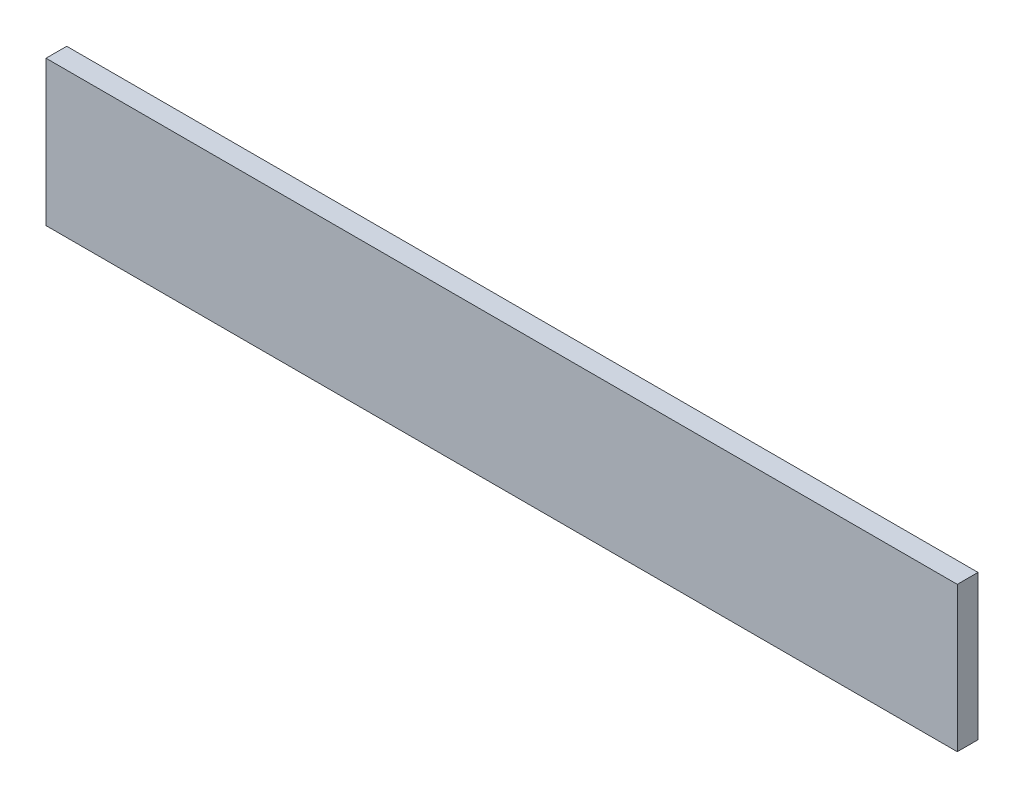
ISO-10303-21;
HEADER;
FILE_DESCRIPTION(('STEP AP214'),'2;1');
FILE_NAME('part.step','',(''),(''),'','','');
FILE_SCHEMA(('AUTOMOTIVE_DESIGN { 1 0 10303 214 1 1 1 1 }'));
ENDSEC;
DATA;
#1=APPLICATION_CONTEXT('core data for automotive mechanical design processes');
#2=APPLICATION_PROTOCOL_DEFINITION('international standard','automotive_design',2000,#1);
#3=PRODUCT_CONTEXT('',#1,'mechanical');
#4=PRODUCT('Part','Part','',(#3));
#5=PRODUCT_RELATED_PRODUCT_CATEGORY('part','',(#4));
#6=PRODUCT_DEFINITION_FORMATION('','',#4);
#7=PRODUCT_DEFINITION_CONTEXT('part definition',#1,'design');
#8=PRODUCT_DEFINITION('design','',#6,#7);
#9=PRODUCT_DEFINITION_SHAPE('','',#8);
#10=(LENGTH_UNIT() NAMED_UNIT(*) SI_UNIT(.MILLI.,.METRE.));
#11=(NAMED_UNIT(*) PLANE_ANGLE_UNIT() SI_UNIT($,.RADIAN.));
#12=(NAMED_UNIT(*) SI_UNIT($,.STERADIAN.) SOLID_ANGLE_UNIT());
#13=UNCERTAINTY_MEASURE_WITH_UNIT(LENGTH_MEASURE(1.E-05),#10,'distance_accuracy_value','');
#14=(GEOMETRIC_REPRESENTATION_CONTEXT(3) GLOBAL_UNCERTAINTY_ASSIGNED_CONTEXT((#13)) GLOBAL_UNIT_ASSIGNED_CONTEXT((#10,
#11,#12)) REPRESENTATION_CONTEXT('',''));
#15=CARTESIAN_POINT('',(0.,0.,0.));
#16=DIRECTION('',(0.,0.,1.));
#17=DIRECTION('',(1.,0.,0.));
#18=AXIS2_PLACEMENT_3D('',#15,#16,#17);
#19=CARTESIAN_POINT('',(0.,0.,5.));
#20=DIRECTION('',(1.,0.,0.));
#21=DIRECTION('',(0.,0.,-1.));
#22=AXIS2_PLACEMENT_3D('',#19,#20,#21);
#23=PLANE('',#22);
#24=DIRECTION('',(0.,-1.,0.));
#25=VECTOR('',#24,1.);
#26=CARTESIAN_POINT('',(0.,0.,0.));
#27=LINE('',#26,#25);
#28=CARTESIAN_POINT('',(0.,35.,0.));
#29=VERTEX_POINT('',#28);
#30=CARTESIAN_POINT('',(0.,0.,0.));
#31=VERTEX_POINT('',#30);
#32=EDGE_CURVE('E96',#29,#31,#27,.T.);
#33=ORIENTED_EDGE('',*,*,#32,.T.);
#34=DIRECTION('',(0.,0.,-1.));
#35=VECTOR('',#34,1.);
#36=CARTESIAN_POINT('',(0.,0.,5.));
#37=LINE('',#36,#35);
#38=CARTESIAN_POINT('',(0.,0.,5.));
#39=VERTEX_POINT('',#38);
#40=EDGE_CURVE('E11',#39,#31,#37,.T.);
#41=ORIENTED_EDGE('',*,*,#40,.F.);
#42=DIRECTION('',(0.,-1.,0.));
#43=VECTOR('',#42,1.);
#44=CARTESIAN_POINT('',(0.,0.,5.));
#45=LINE('',#44,#43);
#46=CARTESIAN_POINT('',(0.,35.,5.));
#47=VERTEX_POINT('',#46);
#48=EDGE_CURVE('E84',#47,#39,#45,.T.);
#49=ORIENTED_EDGE('',*,*,#48,.F.);
#50=DIRECTION('',(0.,0.,-1.));
#51=VECTOR('',#50,1.);
#52=CARTESIAN_POINT('',(0.,35.,5.));
#53=LINE('',#52,#51);
#54=EDGE_CURVE('E92',#47,#29,#53,.T.);
#55=ORIENTED_EDGE('',*,*,#54,.T.);
#56=EDGE_LOOP('',(#33,#41,#49,#55));
#57=FACE_BOUND('',#56,.T.);
#58=ADVANCED_FACE('F33',(#57),#23,.F.);
#59=CARTESIAN_POINT('',(0.,0.,5.));
#60=DIRECTION('',(0.,1.,0.));
#61=DIRECTION('',(0.,0.,1.));
#62=AXIS2_PLACEMENT_3D('',#59,#60,#61);
#63=PLANE('',#62);
#64=DIRECTION('',(1.,0.,0.));
#65=VECTOR('',#64,1.);
#66=CARTESIAN_POINT('',(0.,0.,0.));
#67=LINE('',#66,#65);
#68=CARTESIAN_POINT('',(220.,0.,0.));
#69=VERTEX_POINT('',#68);
#70=EDGE_CURVE('E88',#31,#69,#67,.T.);
#71=ORIENTED_EDGE('',*,*,#70,.T.);
#72=DIRECTION('',(0.,0.,-1.));
#73=VECTOR('',#72,1.);
#74=CARTESIAN_POINT('',(220.,0.,5.));
#75=LINE('',#74,#73);
#76=CARTESIAN_POINT('',(220.,0.,5.));
#77=VERTEX_POINT('',#76);
#78=EDGE_CURVE('E41',#77,#69,#75,.T.);
#79=ORIENTED_EDGE('',*,*,#78,.F.);
#80=DIRECTION('',(1.,0.,0.));
#81=VECTOR('',#80,1.);
#82=CARTESIAN_POINT('',(0.,0.,5.));
#83=LINE('',#82,#81);
#84=EDGE_CURVE('E79',#39,#77,#83,.T.);
#85=ORIENTED_EDGE('',*,*,#84,.F.);
#86=ORIENTED_EDGE('',*,*,#40,.T.);
#87=EDGE_LOOP('',(#71,#79,#85,#86));
#88=FACE_BOUND('',#87,.T.);
#89=ADVANCED_FACE('F87',(#88),#63,.F.);
#90=CARTESIAN_POINT('',(220.,0.,5.));
#91=DIRECTION('',(-1.,0.,0.));
#92=DIRECTION('',(0.,0.,1.));
#93=AXIS2_PLACEMENT_3D('',#90,#91,#92);
#94=PLANE('',#93);
#95=DIRECTION('',(0.,1.,0.));
#96=VECTOR('',#95,1.);
#97=CARTESIAN_POINT('',(220.,0.,0.));
#98=LINE('',#97,#96);
#99=CARTESIAN_POINT('',(220.,35.,0.));
#100=VERTEX_POINT('',#99);
#101=EDGE_CURVE('E66',#69,#100,#98,.T.);
#102=ORIENTED_EDGE('',*,*,#101,.T.);
#103=DIRECTION('',(0.,0.,-1.));
#104=VECTOR('',#103,1.);
#105=CARTESIAN_POINT('',(220.,35.,5.));
#106=LINE('',#105,#104);
#107=CARTESIAN_POINT('',(220.,35.,5.));
#108=VERTEX_POINT('',#107);
#109=EDGE_CURVE('E89',#108,#100,#106,.T.);
#110=ORIENTED_EDGE('',*,*,#109,.F.);
#111=DIRECTION('',(0.,1.,0.));
#112=VECTOR('',#111,1.);
#113=CARTESIAN_POINT('',(220.,0.,5.));
#114=LINE('',#113,#112);
#115=EDGE_CURVE('E82',#77,#108,#114,.T.);
#116=ORIENTED_EDGE('',*,*,#115,.F.);
#117=ORIENTED_EDGE('',*,*,#78,.T.);
#118=EDGE_LOOP('',(#102,#110,#116,#117));
#119=FACE_BOUND('',#118,.T.);
#120=ADVANCED_FACE('F90',(#119),#94,.F.);
#121=CARTESIAN_POINT('',(0.,35.,5.));
#122=DIRECTION('',(0.,-1.,0.));
#123=DIRECTION('',(0.,0.,-1.));
#124=AXIS2_PLACEMENT_3D('',#121,#122,#123);
#125=PLANE('',#124);
#126=DIRECTION('',(-1.,0.,0.));
#127=VECTOR('',#126,1.);
#128=CARTESIAN_POINT('',(0.,35.,0.));
#129=LINE('',#128,#127);
#130=EDGE_CURVE('E72',#100,#29,#129,.T.);
#131=ORIENTED_EDGE('',*,*,#130,.T.);
#132=ORIENTED_EDGE('',*,*,#54,.F.);
#133=DIRECTION('',(-1.,0.,0.));
#134=VECTOR('',#133,1.);
#135=CARTESIAN_POINT('',(0.,35.,5.));
#136=LINE('',#135,#134);
#137=EDGE_CURVE('E49',#108,#47,#136,.T.);
#138=ORIENTED_EDGE('',*,*,#137,.F.);
#139=ORIENTED_EDGE('',*,*,#109,.T.);
#140=EDGE_LOOP('',(#131,#132,#138,#139));
#141=FACE_BOUND('',#140,.T.);
#142=ADVANCED_FACE('F103',(#141),#125,.F.);
#143=CARTESIAN_POINT('',(0.,0.,5.));
#144=DIRECTION('',(0.,0.,-1.));
#145=DIRECTION('',(-1.,0.,0.));
#146=AXIS2_PLACEMENT_3D('',#143,#144,#145);
#147=PLANE('',#146);
#148=ORIENTED_EDGE('',*,*,#48,.T.);
#149=ORIENTED_EDGE('',*,*,#84,.T.);
#150=ORIENTED_EDGE('',*,*,#115,.T.);
#151=ORIENTED_EDGE('',*,*,#137,.T.);
#152=EDGE_LOOP('',(#148,#149,#150,#151));
#153=FACE_BOUND('',#152,.T.);
#154=ADVANCED_FACE('F80',(#153),#147,.F.);
#155=CARTESIAN_POINT('',(0.,0.,0.));
#156=DIRECTION('',(0.,0.,-1.));
#157=DIRECTION('',(-1.,0.,0.));
#158=AXIS2_PLACEMENT_3D('',#155,#156,#157);
#159=PLANE('',#158);
#160=ORIENTED_EDGE('',*,*,#32,.F.);
#161=ORIENTED_EDGE('',*,*,#130,.F.);
#162=ORIENTED_EDGE('',*,*,#101,.F.);
#163=ORIENTED_EDGE('',*,*,#70,.F.);
#164=EDGE_LOOP('',(#160,#161,#162,#163));
#165=FACE_BOUND('',#164,.T.);
#166=ADVANCED_FACE('F106',(#165),#159,.T.);
#167=CLOSED_SHELL('',(#58,#89,#120,#142,#154,#166));
#168=MANIFOLD_SOLID_BREP('B2',#167);
#169=ADVANCED_BREP_SHAPE_REPRESENTATION('',(#18,#168),#14);
#170=SHAPE_DEFINITION_REPRESENTATION(#9,#169);
ENDSEC;
END-ISO-10303-21;
